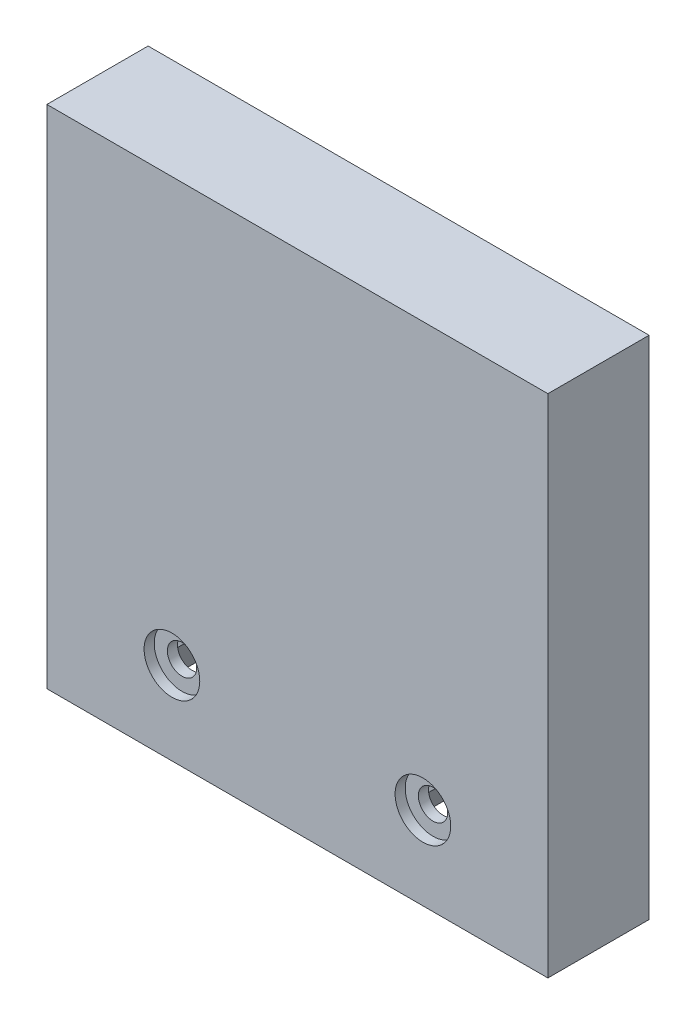
ISO-10303-21;
HEADER;
FILE_DESCRIPTION(('STEP AP214'),'2;1');
FILE_NAME('part.step','',(''),(''),'','','');
FILE_SCHEMA(('AUTOMOTIVE_DESIGN { 1 0 10303 214 1 1 1 1 }'));
ENDSEC;
DATA;
#1=APPLICATION_CONTEXT('core data for automotive mechanical design processes');
#2=APPLICATION_PROTOCOL_DEFINITION('international standard','automotive_design',2000,#1);
#3=PRODUCT_CONTEXT('',#1,'mechanical');
#4=PRODUCT('Part','Part','',(#3));
#5=PRODUCT_RELATED_PRODUCT_CATEGORY('part','',(#4));
#6=PRODUCT_DEFINITION_FORMATION('','',#4);
#7=PRODUCT_DEFINITION_CONTEXT('part definition',#1,'design');
#8=PRODUCT_DEFINITION('design','',#6,#7);
#9=PRODUCT_DEFINITION_SHAPE('','',#8);
#10=(LENGTH_UNIT() NAMED_UNIT(*) SI_UNIT(.MILLI.,.METRE.));
#11=(NAMED_UNIT(*) PLANE_ANGLE_UNIT() SI_UNIT($,.RADIAN.));
#12=(NAMED_UNIT(*) SI_UNIT($,.STERADIAN.) SOLID_ANGLE_UNIT());
#13=UNCERTAINTY_MEASURE_WITH_UNIT(LENGTH_MEASURE(1.E-05),#10,'distance_accuracy_value','');
#14=(GEOMETRIC_REPRESENTATION_CONTEXT(3) GLOBAL_UNCERTAINTY_ASSIGNED_CONTEXT((#13)) GLOBAL_UNIT_ASSIGNED_CONTEXT((#10,
#11,#12)) REPRESENTATION_CONTEXT('',''));
#15=CARTESIAN_POINT('',(0.,0.,0.));
#16=DIRECTION('',(0.,0.,1.));
#17=DIRECTION('',(1.,0.,0.));
#18=AXIS2_PLACEMENT_3D('',#15,#16,#17);
#19=CARTESIAN_POINT('',(-10.5223871498306,8.19615242270662,16.));
#20=DIRECTION('',(0.,0.,-1.));
#21=DIRECTION('',(-1.,0.,0.));
#22=AXIS2_PLACEMENT_3D('',#19,#20,#21);
#23=CYLINDRICAL_SURFACE('',#22,1.45);
#24=CARTESIAN_POINT('',(-10.5223871498306,8.19615242270662,8.));
#25=DIRECTION('',(0.,0.,-1.));
#26=DIRECTION('',(-1.,0.,0.));
#27=AXIS2_PLACEMENT_3D('',#24,#25,#26);
#28=CIRCLE('',#27,1.45);
#29=CARTESIAN_POINT('',(-11.9723871498306,8.19615242270662,8.));
#30=VERTEX_POINT('',#29);
#31=EDGE_CURVE('E181',#30,#30,#28,.T.);
#32=ORIENTED_EDGE('',*,*,#31,.T.);
#33=EDGE_LOOP('',(#32));
#34=FACE_BOUND('',#33,.T.);
#35=CARTESIAN_POINT('',(-10.5223871498306,8.19615242270662,9.));
#36=DIRECTION('',(0.,0.,1.));
#37=DIRECTION('',(1.,0.,0.));
#38=AXIS2_PLACEMENT_3D('',#35,#36,#37);
#39=CIRCLE('',#38,1.45);
#40=CARTESIAN_POINT('',(-9.07238714983058,8.19615242270662,9.));
#41=VERTEX_POINT('',#40);
#42=EDGE_CURVE('E53',#41,#41,#39,.F.);
#43=ORIENTED_EDGE('',*,*,#42,.F.);
#44=EDGE_LOOP('',(#43));
#45=FACE_BOUND('',#44,.T.);
#46=ADVANCED_FACE('F49',(#34,#45),#23,.F.);
#47=CARTESIAN_POINT('',(14.2776128501694,8.19615242270662,16.));
#48=DIRECTION('',(0.,0.,-1.));
#49=DIRECTION('',(-1.,0.,0.));
#50=AXIS2_PLACEMENT_3D('',#47,#48,#49);
#51=CYLINDRICAL_SURFACE('',#50,1.45);
#52=CARTESIAN_POINT('',(14.2776128501694,8.19615242270662,8.));
#53=DIRECTION('',(0.,0.,-1.));
#54=DIRECTION('',(-1.,0.,0.));
#55=AXIS2_PLACEMENT_3D('',#52,#53,#54);
#56=CIRCLE('',#55,1.45);
#57=CARTESIAN_POINT('',(12.8276128501694,8.19615242270662,8.));
#58=VERTEX_POINT('',#57);
#59=EDGE_CURVE('E203',#58,#58,#56,.T.);
#60=ORIENTED_EDGE('',*,*,#59,.T.);
#61=EDGE_LOOP('',(#60));
#62=FACE_BOUND('',#61,.T.);
#63=CARTESIAN_POINT('',(14.2776128501694,8.19615242270662,9.));
#64=DIRECTION('',(0.,0.,1.));
#65=DIRECTION('',(1.,0.,0.));
#66=AXIS2_PLACEMENT_3D('',#63,#64,#65);
#67=CIRCLE('',#66,1.45);
#68=CARTESIAN_POINT('',(15.7276128501694,8.19615242270662,9.));
#69=VERTEX_POINT('',#68);
#70=EDGE_CURVE('E277',#69,#69,#67,.F.);
#71=ORIENTED_EDGE('',*,*,#70,.F.);
#72=EDGE_LOOP('',(#71));
#73=FACE_BOUND('',#72,.T.);
#74=ADVANCED_FACE('F334',(#62,#73),#51,.F.);
#75=CARTESIAN_POINT('',(-22.8747117944775,0.,10.));
#76=DIRECTION('',(1.,0.,0.));
#77=DIRECTION('',(0.,0.,-1.));
#78=AXIS2_PLACEMENT_3D('',#75,#76,#77);
#79=PLANE('',#78);
#80=DIRECTION('',(0.,-1.,0.));
#81=VECTOR('',#80,1.);
#82=CARTESIAN_POINT('',(-22.8747117944775,0.,0.));
#83=LINE('',#82,#81);
#84=CARTESIAN_POINT('',(-22.8747117944775,50.0006190565255,0.));
#85=VERTEX_POINT('',#84);
#86=CARTESIAN_POINT('',(-22.8747117944775,0.,0.));
#87=VERTEX_POINT('',#86);
#88=EDGE_CURVE('E239',#85,#87,#83,.T.);
#89=ORIENTED_EDGE('',*,*,#88,.T.);
#90=DIRECTION('',(0.,0.,-1.));
#91=VECTOR('',#90,1.);
#92=CARTESIAN_POINT('',(-22.8747117944775,0.,10.));
#93=LINE('',#92,#91);
#94=CARTESIAN_POINT('',(-22.8747117944775,0.,10.));
#95=VERTEX_POINT('',#94);
#96=EDGE_CURVE('E273',#95,#87,#93,.T.);
#97=ORIENTED_EDGE('',*,*,#96,.F.);
#98=DIRECTION('',(0.,-1.,0.));
#99=VECTOR('',#98,1.);
#100=CARTESIAN_POINT('',(-22.8747117944775,0.,10.));
#101=LINE('',#100,#99);
#102=CARTESIAN_POINT('',(-22.8747117944775,50.0006190565255,10.));
#103=VERTEX_POINT('',#102);
#104=EDGE_CURVE('E240',#103,#95,#101,.T.);
#105=ORIENTED_EDGE('',*,*,#104,.F.);
#106=DIRECTION('',(0.,0.,-1.));
#107=VECTOR('',#106,1.);
#108=CARTESIAN_POINT('',(-22.8747117944775,50.0006190565255,10.));
#109=LINE('',#108,#107);
#110=EDGE_CURVE('E250',#103,#85,#109,.T.);
#111=ORIENTED_EDGE('',*,*,#110,.T.);
#112=EDGE_LOOP('',(#89,#97,#105,#111));
#113=FACE_BOUND('',#112,.T.);
#114=ADVANCED_FACE('F51',(#113),#79,.F.);
#115=CARTESIAN_POINT('',(-22.8747117944775,0.,10.));
#116=DIRECTION('',(0.,1.,0.));
#117=DIRECTION('',(0.,0.,1.));
#118=AXIS2_PLACEMENT_3D('',#115,#116,#117);
#119=PLANE('',#118);
#120=DIRECTION('',(1.,0.,0.));
#121=VECTOR('',#120,1.);
#122=CARTESIAN_POINT('',(-22.8747117944775,0.,0.));
#123=LINE('',#122,#121);
#124=CARTESIAN_POINT('',(-17.7556966529578,0.,0.));
#125=VERTEX_POINT('',#124);
#126=EDGE_CURVE('E255',#87,#125,#123,.T.);
#127=ORIENTED_EDGE('',*,*,#126,.T.);
#128=DIRECTION('',(0.,0.,1.));
#129=VECTOR('',#128,1.);
#130=CARTESIAN_POINT('',(-17.7556966529578,0.,10.));
#131=LINE('',#130,#129);
#132=CARTESIAN_POINT('',(-17.7556966529578,0.,8.));
#133=VERTEX_POINT('',#132);
#134=EDGE_CURVE('E235',#125,#133,#131,.T.);
#135=ORIENTED_EDGE('',*,*,#134,.T.);
#136=DIRECTION('',(1.,0.,0.));
#137=VECTOR('',#136,1.);
#138=CARTESIAN_POINT('',(-22.8747117944775,0.,8.));
#139=LINE('',#138,#137);
#140=CARTESIAN_POINT('',(21.5061835883938,0.,8.));
#141=VERTEX_POINT('',#140);
#142=EDGE_CURVE('E11',#133,#141,#139,.T.);
#143=ORIENTED_EDGE('',*,*,#142,.T.);
#144=DIRECTION('',(0.,0.,-1.));
#145=VECTOR('',#144,1.);
#146=CARTESIAN_POINT('',(21.5061835883938,0.,10.));
#147=LINE('',#146,#145);
#148=CARTESIAN_POINT('',(21.5061835883938,0.,0.));
#149=VERTEX_POINT('',#148);
#150=EDGE_CURVE('E220',#141,#149,#147,.T.);
#151=ORIENTED_EDGE('',*,*,#150,.T.);
#152=CARTESIAN_POINT('',(26.6252882055225,0.,0.));
#153=VERTEX_POINT('',#152);
#154=EDGE_CURVE('E254',#149,#153,#123,.T.);
#155=ORIENTED_EDGE('',*,*,#154,.T.);
#156=DIRECTION('',(0.,0.,-1.));
#157=VECTOR('',#156,1.);
#158=CARTESIAN_POINT('',(26.6252882055225,0.,10.));
#159=LINE('',#158,#157);
#160=CARTESIAN_POINT('',(26.6252882055225,0.,10.));
#161=VERTEX_POINT('',#160);
#162=EDGE_CURVE('E269',#161,#153,#159,.T.);
#163=ORIENTED_EDGE('',*,*,#162,.F.);
#164=DIRECTION('',(1.,0.,0.));
#165=VECTOR('',#164,1.);
#166=CARTESIAN_POINT('',(-22.8747117944775,0.,10.));
#167=LINE('',#166,#165);
#168=EDGE_CURVE('E105',#95,#161,#167,.T.);
#169=ORIENTED_EDGE('',*,*,#168,.F.);
#170=ORIENTED_EDGE('',*,*,#96,.T.);
#171=EDGE_LOOP('',(#127,#135,#143,#151,#155,#163,#169,#170));
#172=FACE_BOUND('',#171,.T.);
#173=ADVANCED_FACE('F374',(#172),#119,.F.);
#174=CARTESIAN_POINT('',(26.6252882055225,0.,10.));
#175=DIRECTION('',(-1.,0.,0.));
#176=DIRECTION('',(0.,0.,1.));
#177=AXIS2_PLACEMENT_3D('',#174,#175,#176);
#178=PLANE('',#177);
#179=DIRECTION('',(0.,1.,0.));
#180=VECTOR('',#179,1.);
#181=CARTESIAN_POINT('',(26.6252882055225,0.,0.));
#182=LINE('',#181,#180);
#183=CARTESIAN_POINT('',(26.6252882055225,50.0006190565255,0.));
#184=VERTEX_POINT('',#183);
#185=EDGE_CURVE('E259',#153,#184,#182,.T.);
#186=ORIENTED_EDGE('',*,*,#185,.T.);
#187=DIRECTION('',(0.,0.,-1.));
#188=VECTOR('',#187,1.);
#189=CARTESIAN_POINT('',(26.6252882055225,50.0006190565255,10.));
#190=LINE('',#189,#188);
#191=CARTESIAN_POINT('',(26.6252882055225,50.0006190565255,10.));
#192=VERTEX_POINT('',#191);
#193=EDGE_CURVE('E266',#192,#184,#190,.T.);
#194=ORIENTED_EDGE('',*,*,#193,.F.);
#195=DIRECTION('',(0.,1.,0.));
#196=VECTOR('',#195,1.);
#197=CARTESIAN_POINT('',(26.6252882055225,0.,10.));
#198=LINE('',#197,#196);
#199=EDGE_CURVE('E245',#161,#192,#198,.T.);
#200=ORIENTED_EDGE('',*,*,#199,.F.);
#201=ORIENTED_EDGE('',*,*,#162,.T.);
#202=EDGE_LOOP('',(#186,#194,#200,#201));
#203=FACE_BOUND('',#202,.T.);
#204=ADVANCED_FACE('F383',(#203),#178,.F.);
#205=CARTESIAN_POINT('',(-22.8747117944775,50.0006190565255,10.));
#206=DIRECTION('',(0.,-1.,0.));
#207=DIRECTION('',(0.,0.,-1.));
#208=AXIS2_PLACEMENT_3D('',#205,#206,#207);
#209=PLANE('',#208);
#210=DIRECTION('',(-1.,0.,0.));
#211=VECTOR('',#210,1.);
#212=CARTESIAN_POINT('',(-22.8747117944775,50.0006190565255,0.));
#213=LINE('',#212,#211);
#214=EDGE_CURVE('E97',#184,#85,#213,.T.);
#215=ORIENTED_EDGE('',*,*,#214,.T.);
#216=ORIENTED_EDGE('',*,*,#110,.F.);
#217=DIRECTION('',(-1.,0.,0.));
#218=VECTOR('',#217,1.);
#219=CARTESIAN_POINT('',(-22.8747117944775,50.0006190565255,10.));
#220=LINE('',#219,#218);
#221=EDGE_CURVE('E76',#192,#103,#220,.T.);
#222=ORIENTED_EDGE('',*,*,#221,.F.);
#223=ORIENTED_EDGE('',*,*,#193,.T.);
#224=EDGE_LOOP('',(#215,#216,#222,#223));
#225=FACE_BOUND('',#224,.T.);
#226=ADVANCED_FACE('F385',(#225),#209,.F.);
#227=CARTESIAN_POINT('',(0.,0.,10.));
#228=DIRECTION('',(0.,0.,-1.));
#229=DIRECTION('',(-1.,0.,0.));
#230=AXIS2_PLACEMENT_3D('',#227,#228,#229);
#231=PLANE('',#230);
#232=CARTESIAN_POINT('',(-10.5223871498306,8.19615242270662,10.));
#233=DIRECTION('',(0.,0.,1.));
#234=DIRECTION('',(1.,0.,0.));
#235=AXIS2_PLACEMENT_3D('',#232,#233,#234);
#236=CIRCLE('',#235,2.75);
#237=CARTESIAN_POINT('',(-7.77238714983058,8.19615242270662,10.));
#238=VERTEX_POINT('',#237);
#239=EDGE_CURVE('E287',#238,#238,#236,.T.);
#240=ORIENTED_EDGE('',*,*,#239,.F.);
#241=EDGE_LOOP('',(#240));
#242=FACE_BOUND('',#241,.T.);
#243=CARTESIAN_POINT('',(14.2776128501694,8.19615242270662,10.));
#244=DIRECTION('',(0.,0.,1.));
#245=DIRECTION('',(1.,0.,0.));
#246=AXIS2_PLACEMENT_3D('',#243,#244,#245);
#247=CIRCLE('',#246,2.75);
#248=CARTESIAN_POINT('',(17.0276128501694,8.19615242270662,10.));
#249=VERTEX_POINT('',#248);
#250=EDGE_CURVE('E293',#249,#249,#247,.T.);
#251=ORIENTED_EDGE('',*,*,#250,.F.);
#252=EDGE_LOOP('',(#251));
#253=FACE_BOUND('',#252,.T.);
#254=ORIENTED_EDGE('',*,*,#104,.T.);
#255=ORIENTED_EDGE('',*,*,#168,.T.);
#256=ORIENTED_EDGE('',*,*,#199,.T.);
#257=ORIENTED_EDGE('',*,*,#221,.T.);
#258=EDGE_LOOP('',(#254,#255,#256,#257));
#259=FACE_BOUND('',#258,.T.);
#260=ADVANCED_FACE('F329',(#242,#253,#259),#231,.F.);
#261=CARTESIAN_POINT('',(0.,0.,0.));
#262=DIRECTION('',(0.,0.,-1.));
#263=DIRECTION('',(-1.,0.,0.));
#264=AXIS2_PLACEMENT_3D('',#261,#262,#263);
#265=PLANE('',#264);
#266=CARTESIAN_POINT('',(1.87527344222982,33.5006190565255,0.));
#267=DIRECTION('',(0.,0.,-1.));
#268=DIRECTION('',(-1.,0.,0.));
#269=AXIS2_PLACEMENT_3D('',#266,#267,#268);
#270=CIRCLE('',#269,5.);
#271=CARTESIAN_POINT('',(-3.12472655777018,33.5006190565255,0.));
#272=VERTEX_POINT('',#271);
#273=EDGE_CURVE('E296',#272,#272,#270,.T.);
#274=ORIENTED_EDGE('',*,*,#273,.F.);
#275=EDGE_LOOP('',(#274));
#276=FACE_BOUND('',#275,.T.);
#277=DIRECTION('',(0.500290496149243,0.865857620779966,0.));
#278=VECTOR('',#277,1.);
#279=CARTESIAN_POINT('',(-13.3116130298456,7.69141868988707,0.));
#280=LINE('',#279,#278);
#281=CARTESIAN_POINT('',(-14.7607236751979,5.18342882142201,0.));
#282=VERTEX_POINT('',#281);
#283=EDGE_CURVE('E59',#125,#282,#280,.T.);
#284=ORIENTED_EDGE('',*,*,#283,.F.);
#285=ORIENTED_EDGE('',*,*,#126,.F.);
#286=ORIENTED_EDGE('',*,*,#88,.F.);
#287=ORIENTED_EDGE('',*,*,#214,.F.);
#288=ORIENTED_EDGE('',*,*,#185,.F.);
#289=ORIENTED_EDGE('',*,*,#154,.F.);
#290=DIRECTION('',(0.499709334976619,-0.866193154289056,0.));
#291=VECTOR('',#290,1.);
#292=CARTESIAN_POINT('',(21.6215641666175,-0.2,0.));
#293=LINE('',#292,#291);
#294=CARTESIAN_POINT('',(18.5158937002529,5.18335049828226,0.));
#295=VERTEX_POINT('',#294);
#296=EDGE_CURVE('E175',#295,#149,#293,.T.);
#297=ORIENTED_EDGE('',*,*,#296,.F.);
#298=CARTESIAN_POINT('',(14.2776128501694,8.19615242270664,0.));
#299=DIRECTION('',(0.,0.,-1.));
#300=DIRECTION('',(1.,0.,0.));
#301=AXIS2_PLACEMENT_3D('',#298,#299,#300);
#302=CIRCLE('',#301,5.2);
#303=CARTESIAN_POINT('',(10.0393041598277,5.18338966314959,0.));
#304=VERTEX_POINT('',#303);
#305=EDGE_CURVE('E178',#304,#295,#302,.T.);
#306=ORIENTED_EDGE('',*,*,#305,.F.);
#307=DIRECTION('',(0.499999999999998,0.86602540378444,0.));
#308=VECTOR('',#307,1.);
#309=CARTESIAN_POINT('',(10.0393041598277,5.18338966314959,0.));
#310=LINE('',#309,#308);
#311=CARTESIAN_POINT('',(8.01084769204025,1.67,0.));
#312=VERTEX_POINT('',#311);
#313=EDGE_CURVE('E210',#312,#304,#310,.T.);
#314=ORIENTED_EDGE('',*,*,#313,.F.);
#315=DIRECTION('',(1.,0.,0.));
#316=VECTOR('',#315,1.);
#317=CARTESIAN_POINT('',(8.01084769204025,1.67,0.));
#318=LINE('',#317,#316);
#319=CARTESIAN_POINT('',(-4.25724423977455,1.67,0.));
#320=VERTEX_POINT('',#319);
#321=EDGE_CURVE('E206',#320,#312,#318,.T.);
#322=ORIENTED_EDGE('',*,*,#321,.F.);
#323=DIRECTION('',(0.499709334976619,-0.866193154289057,0.));
#324=VECTOR('',#323,1.);
#325=CARTESIAN_POINT('',(-4.25724423977455,1.67,0.));
#326=LINE('',#325,#324);
#327=CARTESIAN_POINT('',(-6.28410629974705,5.18335049828226,0.));
#328=VERTEX_POINT('',#327);
#329=EDGE_CURVE('E202',#328,#320,#326,.T.);
#330=ORIENTED_EDGE('',*,*,#329,.F.);
#331=CARTESIAN_POINT('',(-10.5223871498306,8.19615242270664,0.));
#332=DIRECTION('',(0.,0.,-1.));
#333=DIRECTION('',(1.,0.,0.));
#334=AXIS2_PLACEMENT_3D('',#331,#332,#333);
#335=CIRCLE('',#334,5.2);
#336=EDGE_CURVE('E67',#282,#328,#335,.T.);
#337=ORIENTED_EDGE('',*,*,#336,.F.);
#338=EDGE_LOOP('',(#284,#285,#286,#287,#288,#289,#297,#306,#314,#322,#330,#337));
#339=FACE_BOUND('',#338,.T.);
#340=ADVANCED_FACE('F318',(#276,#339),#265,.T.);
#341=CARTESIAN_POINT('',(-10.5223871498306,8.19615242270664,8.));
#342=DIRECTION('',(0.,0.,1.));
#343=DIRECTION('',(1.,0.,0.));
#344=AXIS2_PLACEMENT_3D('',#341,#342,#343);
#345=PLANE('',#344);
#346=ORIENTED_EDGE('',*,*,#59,.F.);
#347=EDGE_LOOP('',(#346));
#348=FACE_BOUND('',#347,.T.);
#349=ORIENTED_EDGE('',*,*,#31,.F.);
#350=EDGE_LOOP('',(#349));
#351=FACE_BOUND('',#350,.T.);
#352=DIRECTION('',(0.500290496149243,0.865857620779966,0.));
#353=VECTOR('',#352,1.);
#354=CARTESIAN_POINT('',(-17.8712561824099,-0.2,8.));
#355=LINE('',#354,#353);
#356=CARTESIAN_POINT('',(-14.7607236751979,5.18342882142201,8.));
#357=VERTEX_POINT('',#356);
#358=EDGE_CURVE('E160',#133,#357,#355,.T.);
#359=ORIENTED_EDGE('',*,*,#358,.T.);
#360=CARTESIAN_POINT('',(-10.5223871498306,8.19615242270664,8.));
#361=DIRECTION('',(0.,0.,-1.));
#362=DIRECTION('',(1.,0.,0.));
#363=AXIS2_PLACEMENT_3D('',#360,#361,#362);
#364=CIRCLE('',#363,5.2);
#365=CARTESIAN_POINT('',(-6.28410629974705,5.18335049828226,8.));
#366=VERTEX_POINT('',#365);
#367=EDGE_CURVE('E154',#357,#366,#364,.T.);
#368=ORIENTED_EDGE('',*,*,#367,.T.);
#369=DIRECTION('',(0.499709334976619,-0.866193154289057,0.));
#370=VECTOR('',#369,1.);
#371=CARTESIAN_POINT('',(-4.25724423977455,1.67,8.));
#372=LINE('',#371,#370);
#373=CARTESIAN_POINT('',(-4.25724423977455,1.67,8.));
#374=VERTEX_POINT('',#373);
#375=EDGE_CURVE('E163',#366,#374,#372,.T.);
#376=ORIENTED_EDGE('',*,*,#375,.T.);
#377=DIRECTION('',(1.,0.,0.));
#378=VECTOR('',#377,1.);
#379=CARTESIAN_POINT('',(8.01084769204025,1.67,8.));
#380=LINE('',#379,#378);
#381=CARTESIAN_POINT('',(8.01084769204025,1.67,8.));
#382=VERTEX_POINT('',#381);
#383=EDGE_CURVE('E169',#374,#382,#380,.T.);
#384=ORIENTED_EDGE('',*,*,#383,.T.);
#385=DIRECTION('',(0.499999999999998,0.86602540378444,0.));
#386=VECTOR('',#385,1.);
#387=CARTESIAN_POINT('',(10.0393041598277,5.18338966314959,8.));
#388=LINE('',#387,#386);
#389=CARTESIAN_POINT('',(10.0393041598277,5.18338966314959,8.));
#390=VERTEX_POINT('',#389);
#391=EDGE_CURVE('E186',#382,#390,#388,.T.);
#392=ORIENTED_EDGE('',*,*,#391,.T.);
#393=CARTESIAN_POINT('',(14.2776128501694,8.19615242270664,8.));
#394=DIRECTION('',(0.,0.,-1.));
#395=DIRECTION('',(1.,0.,0.));
#396=AXIS2_PLACEMENT_3D('',#393,#394,#395);
#397=CIRCLE('',#396,5.2);
#398=CARTESIAN_POINT('',(18.5158937002529,5.18335049828226,8.));
#399=VERTEX_POINT('',#398);
#400=EDGE_CURVE('E190',#390,#399,#397,.T.);
#401=ORIENTED_EDGE('',*,*,#400,.T.);
#402=DIRECTION('',(0.499709334976619,-0.866193154289056,0.));
#403=VECTOR('',#402,1.);
#404=CARTESIAN_POINT('',(21.6215641666175,-0.2,8.));
#405=LINE('',#404,#403);
#406=EDGE_CURVE('E194',#399,#141,#405,.T.);
#407=ORIENTED_EDGE('',*,*,#406,.T.);
#408=ORIENTED_EDGE('',*,*,#142,.F.);
#409=EDGE_LOOP('',(#359,#368,#376,#384,#392,#401,#407,#408));
#410=FACE_BOUND('',#409,.T.);
#411=ADVANCED_FACE('F171',(#348,#351,#410),#345,.F.);
#412=CARTESIAN_POINT('',(-17.8712561824099,-0.2,8.));
#413=DIRECTION('',(-0.865857620779966,0.500290496149243,0.));
#414=DIRECTION('',(-0.500290496149243,-0.865857620779966,0.));
#415=AXIS2_PLACEMENT_3D('',#412,#413,#414);
#416=PLANE('',#415);
#417=ORIENTED_EDGE('',*,*,#283,.T.);
#418=DIRECTION('',(0.,0.,-1.));
#419=VECTOR('',#418,1.);
#420=CARTESIAN_POINT('',(-14.7607236751979,5.18342882142201,8.));
#421=LINE('',#420,#419);
#422=EDGE_CURVE('E217',#357,#282,#421,.T.);
#423=ORIENTED_EDGE('',*,*,#422,.F.);
#424=ORIENTED_EDGE('',*,*,#358,.F.);
#425=ORIENTED_EDGE('',*,*,#134,.F.);
#426=EDGE_LOOP('',(#417,#423,#424,#425));
#427=FACE_BOUND('',#426,.T.);
#428=ADVANCED_FACE('F317',(#427),#416,.F.);
#429=CARTESIAN_POINT('',(21.6215641666175,-0.2,8.));
#430=DIRECTION('',(0.866193154289056,0.499709334976619,0.));
#431=DIRECTION('',(-0.499709334976619,0.866193154289056,0.));
#432=AXIS2_PLACEMENT_3D('',#429,#430,#431);
#433=PLANE('',#432);
#434=ORIENTED_EDGE('',*,*,#406,.F.);
#435=DIRECTION('',(0.,0.,-1.));
#436=VECTOR('',#435,1.);
#437=CARTESIAN_POINT('',(18.5158937002529,5.18335049828226,8.));
#438=LINE('',#437,#436);
#439=EDGE_CURVE('E221',#399,#295,#438,.T.);
#440=ORIENTED_EDGE('',*,*,#439,.T.);
#441=ORIENTED_EDGE('',*,*,#296,.T.);
#442=ORIENTED_EDGE('',*,*,#150,.F.);
#443=EDGE_LOOP('',(#434,#440,#441,#442));
#444=FACE_BOUND('',#443,.T.);
#445=ADVANCED_FACE('F325',(#444),#433,.F.);
#446=CARTESIAN_POINT('',(-10.5223871498306,8.19615242270664,8.));
#447=DIRECTION('',(0.,0.,-1.));
#448=DIRECTION('',(-1.,0.,0.));
#449=AXIS2_PLACEMENT_3D('',#446,#447,#448);
#450=CYLINDRICAL_SURFACE('',#449,5.2);
#451=ORIENTED_EDGE('',*,*,#336,.T.);
#452=DIRECTION('',(0.,0.,-1.));
#453=VECTOR('',#452,1.);
#454=CARTESIAN_POINT('',(-6.28410629974705,5.18335049828226,8.));
#455=LINE('',#454,#453);
#456=EDGE_CURVE('E150',#366,#328,#455,.T.);
#457=ORIENTED_EDGE('',*,*,#456,.F.);
#458=ORIENTED_EDGE('',*,*,#367,.F.);
#459=ORIENTED_EDGE('',*,*,#422,.T.);
#460=EDGE_LOOP('',(#451,#457,#458,#459));
#461=FACE_BOUND('',#460,.T.);
#462=ADVANCED_FACE('F152',(#461),#450,.F.);
#463=CARTESIAN_POINT('',(14.2776128501694,8.19615242270664,8.));
#464=DIRECTION('',(0.,0.,-1.));
#465=DIRECTION('',(-1.,0.,0.));
#466=AXIS2_PLACEMENT_3D('',#463,#464,#465);
#467=CYLINDRICAL_SURFACE('',#466,5.2);
#468=ORIENTED_EDGE('',*,*,#305,.T.);
#469=ORIENTED_EDGE('',*,*,#439,.F.);
#470=ORIENTED_EDGE('',*,*,#400,.F.);
#471=DIRECTION('',(0.,0.,-1.));
#472=VECTOR('',#471,1.);
#473=CARTESIAN_POINT('',(10.0393041598277,5.18338966314959,8.));
#474=LINE('',#473,#472);
#475=EDGE_CURVE('E224',#390,#304,#474,.T.);
#476=ORIENTED_EDGE('',*,*,#475,.T.);
#477=EDGE_LOOP('',(#468,#469,#470,#476));
#478=FACE_BOUND('',#477,.T.);
#479=ADVANCED_FACE('F392',(#478),#467,.F.);
#480=CARTESIAN_POINT('',(10.0393041598277,5.18338966314959,8.));
#481=DIRECTION('',(-0.86602540378444,0.499999999999998,0.));
#482=DIRECTION('',(-0.499999999999998,-0.86602540378444,0.));
#483=AXIS2_PLACEMENT_3D('',#480,#481,#482);
#484=PLANE('',#483);
#485=ORIENTED_EDGE('',*,*,#313,.T.);
#486=ORIENTED_EDGE('',*,*,#475,.F.);
#487=ORIENTED_EDGE('',*,*,#391,.F.);
#488=DIRECTION('',(0.,0.,-1.));
#489=VECTOR('',#488,1.);
#490=CARTESIAN_POINT('',(8.01084769204025,1.67,8.));
#491=LINE('',#490,#489);
#492=EDGE_CURVE('E227',#382,#312,#491,.T.);
#493=ORIENTED_EDGE('',*,*,#492,.T.);
#494=EDGE_LOOP('',(#485,#486,#487,#493));
#495=FACE_BOUND('',#494,.T.);
#496=ADVANCED_FACE('F397',(#495),#484,.F.);
#497=CARTESIAN_POINT('',(8.01084769204025,1.67,8.));
#498=DIRECTION('',(0.,1.,0.));
#499=DIRECTION('',(0.,0.,1.));
#500=AXIS2_PLACEMENT_3D('',#497,#498,#499);
#501=PLANE('',#500);
#502=ORIENTED_EDGE('',*,*,#321,.T.);
#503=ORIENTED_EDGE('',*,*,#492,.F.);
#504=ORIENTED_EDGE('',*,*,#383,.F.);
#505=DIRECTION('',(0.,0.,-1.));
#506=VECTOR('',#505,1.);
#507=CARTESIAN_POINT('',(-4.25724423977455,1.67,8.));
#508=LINE('',#507,#506);
#509=EDGE_CURVE('E159',#374,#320,#508,.T.);
#510=ORIENTED_EDGE('',*,*,#509,.T.);
#511=EDGE_LOOP('',(#502,#503,#504,#510));
#512=FACE_BOUND('',#511,.T.);
#513=ADVANCED_FACE('F399',(#512),#501,.F.);
#514=CARTESIAN_POINT('',(-4.25724423977455,1.67,8.));
#515=DIRECTION('',(0.866193154289057,0.499709334976619,0.));
#516=DIRECTION('',(-0.499709334976619,0.866193154289057,0.));
#517=AXIS2_PLACEMENT_3D('',#514,#515,#516);
#518=PLANE('',#517);
#519=ORIENTED_EDGE('',*,*,#329,.T.);
#520=ORIENTED_EDGE('',*,*,#509,.F.);
#521=ORIENTED_EDGE('',*,*,#375,.F.);
#522=ORIENTED_EDGE('',*,*,#456,.T.);
#523=EDGE_LOOP('',(#519,#520,#521,#522));
#524=FACE_BOUND('',#523,.T.);
#525=ADVANCED_FACE('F164',(#524),#518,.F.);
#526=CARTESIAN_POINT('',(14.2776128501694,8.19615242270662,9.));
#527=DIRECTION('',(0.,0.,1.));
#528=DIRECTION('',(1.,0.,0.));
#529=AXIS2_PLACEMENT_3D('',#526,#527,#528);
#530=PLANE('',#529);
#531=CARTESIAN_POINT('',(14.2776128501694,8.19615242270662,9.));
#532=DIRECTION('',(0.,0.,1.));
#533=DIRECTION('',(1.,0.,0.));
#534=AXIS2_PLACEMENT_3D('',#531,#532,#533);
#535=CIRCLE('',#534,2.75);
#536=CARTESIAN_POINT('',(17.0276128501694,8.19615242270662,9.));
#537=VERTEX_POINT('',#536);
#538=EDGE_CURVE('E302',#537,#537,#535,.T.);
#539=ORIENTED_EDGE('',*,*,#538,.T.);
#540=EDGE_LOOP('',(#539));
#541=FACE_BOUND('',#540,.T.);
#542=ORIENTED_EDGE('',*,*,#70,.T.);
#543=EDGE_LOOP('',(#542));
#544=FACE_BOUND('',#543,.T.);
#545=ADVANCED_FACE('F340',(#541,#544),#530,.T.);
#546=CARTESIAN_POINT('',(14.2776128501694,8.19615242270662,9.));
#547=DIRECTION('',(0.,0.,1.));
#548=DIRECTION('',(1.,0.,0.));
#549=AXIS2_PLACEMENT_3D('',#546,#547,#548);
#550=CYLINDRICAL_SURFACE('',#549,2.75);
#551=ORIENTED_EDGE('',*,*,#538,.F.);
#552=EDGE_LOOP('',(#551));
#553=FACE_BOUND('',#552,.T.);
#554=ORIENTED_EDGE('',*,*,#250,.T.);
#555=EDGE_LOOP('',(#554));
#556=FACE_BOUND('',#555,.T.);
#557=ADVANCED_FACE('F343',(#553,#556),#550,.F.);
#558=CARTESIAN_POINT('',(-10.5223871498306,8.19615242270662,9.));
#559=DIRECTION('',(0.,0.,1.));
#560=DIRECTION('',(1.,0.,0.));
#561=AXIS2_PLACEMENT_3D('',#558,#559,#560);
#562=PLANE('',#561);
#563=CARTESIAN_POINT('',(-10.5223871498306,8.19615242270662,9.));
#564=DIRECTION('',(0.,0.,1.));
#565=DIRECTION('',(1.,0.,0.));
#566=AXIS2_PLACEMENT_3D('',#563,#564,#565);
#567=CIRCLE('',#566,2.75);
#568=CARTESIAN_POINT('',(-7.77238714983058,8.19615242270662,9.));
#569=VERTEX_POINT('',#568);
#570=EDGE_CURVE('E280',#569,#569,#567,.T.);
#571=ORIENTED_EDGE('',*,*,#570,.T.);
#572=EDGE_LOOP('',(#571));
#573=FACE_BOUND('',#572,.T.);
#574=ORIENTED_EDGE('',*,*,#42,.T.);
#575=EDGE_LOOP('',(#574));
#576=FACE_BOUND('',#575,.T.);
#577=ADVANCED_FACE('F347',(#573,#576),#562,.T.);
#578=CARTESIAN_POINT('',(-10.5223871498306,8.19615242270662,9.));
#579=DIRECTION('',(0.,0.,1.));
#580=DIRECTION('',(1.,0.,0.));
#581=AXIS2_PLACEMENT_3D('',#578,#579,#580);
#582=CYLINDRICAL_SURFACE('',#581,2.75);
#583=ORIENTED_EDGE('',*,*,#570,.F.);
#584=EDGE_LOOP('',(#583));
#585=FACE_BOUND('',#584,.T.);
#586=ORIENTED_EDGE('',*,*,#239,.T.);
#587=EDGE_LOOP('',(#586));
#588=FACE_BOUND('',#587,.T.);
#589=ADVANCED_FACE('F349',(#585,#588),#582,.F.);
#590=CARTESIAN_POINT('',(1.87527344222982,33.5006190565255,3.));
#591=DIRECTION('',(0.,0.,-1.));
#592=DIRECTION('',(-1.,0.,0.));
#593=AXIS2_PLACEMENT_3D('',#590,#591,#592);
#594=CYLINDRICAL_SURFACE('',#593,5.);
#595=CARTESIAN_POINT('',(1.87527344222982,33.5006190565255,3.));
#596=DIRECTION('',(0.,0.,-1.));
#597=DIRECTION('',(-1.,0.,0.));
#598=AXIS2_PLACEMENT_3D('',#595,#596,#597);
#599=CIRCLE('',#598,5.);
#600=CARTESIAN_POINT('',(-3.12472655777018,33.5006190565255,3.));
#601=VERTEX_POINT('',#600);
#602=EDGE_CURVE('E305',#601,#601,#599,.T.);
#603=ORIENTED_EDGE('',*,*,#602,.F.);
#604=EDGE_LOOP('',(#603));
#605=FACE_BOUND('',#604,.T.);
#606=ORIENTED_EDGE('',*,*,#273,.T.);
#607=EDGE_LOOP('',(#606));
#608=FACE_BOUND('',#607,.T.);
#609=ADVANCED_FACE('F352',(#605,#608),#594,.F.);
#610=CARTESIAN_POINT('',(1.87527344222982,33.5006190565255,3.));
#611=DIRECTION('',(0.,0.,-1.));
#612=DIRECTION('',(-1.,0.,0.));
#613=AXIS2_PLACEMENT_3D('',#610,#611,#612);
#614=PLANE('',#613);
#615=ORIENTED_EDGE('',*,*,#602,.T.);
#616=EDGE_LOOP('',(#615));
#617=FACE_BOUND('',#616,.T.);
#618=ADVANCED_FACE('F358',(#617),#614,.T.);
#619=CLOSED_SHELL('',(#46,#74,#114,#173,#204,#226,#260,#340,#411,#428,#445,#462,#479,#496,#513,
#525,#545,#557,#577,#589,#609,#618));
#620=MANIFOLD_SOLID_BREP('B2',#619);
#621=ADVANCED_BREP_SHAPE_REPRESENTATION('',(#18,#620),#14);
#622=SHAPE_DEFINITION_REPRESENTATION(#9,#621);
ENDSEC;
END-ISO-10303-21;
